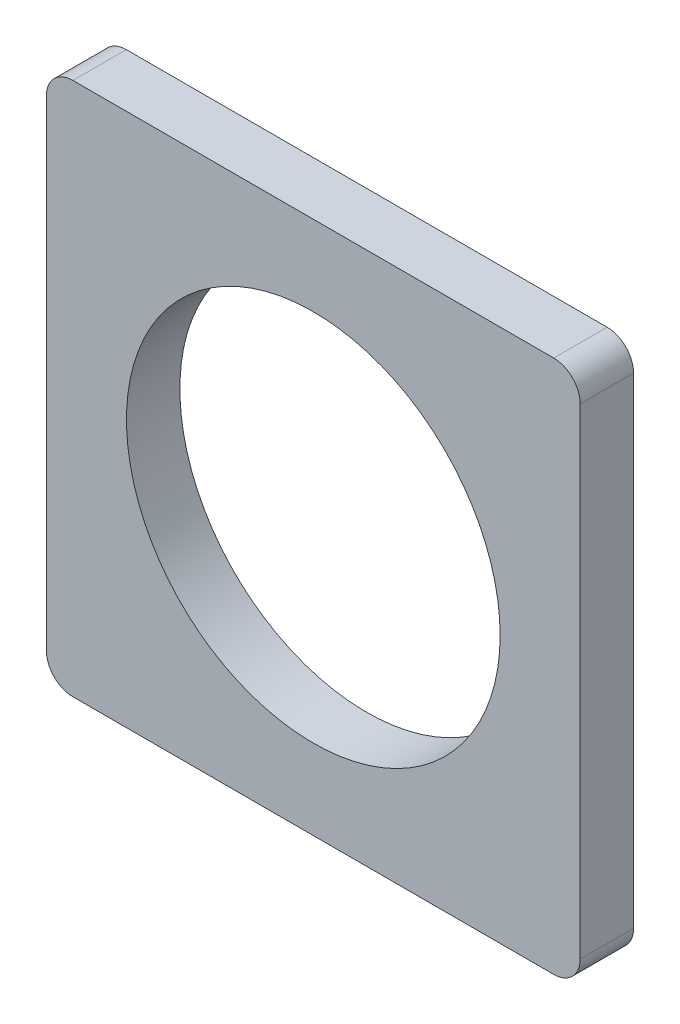
ISO-10303-21;
HEADER;
FILE_DESCRIPTION(('STEP AP214'),'2;1');
FILE_NAME('part.step','',(''),(''),'','','');
FILE_SCHEMA(('AUTOMOTIVE_DESIGN { 1 0 10303 214 1 1 1 1 }'));
ENDSEC;
DATA;
#1=APPLICATION_CONTEXT('core data for automotive mechanical design processes');
#2=APPLICATION_PROTOCOL_DEFINITION('international standard','automotive_design',2000,#1);
#3=PRODUCT_CONTEXT('',#1,'mechanical');
#4=PRODUCT('Part','Part','',(#3));
#5=PRODUCT_RELATED_PRODUCT_CATEGORY('part','',(#4));
#6=PRODUCT_DEFINITION_FORMATION('','',#4);
#7=PRODUCT_DEFINITION_CONTEXT('part definition',#1,'design');
#8=PRODUCT_DEFINITION('design','',#6,#7);
#9=PRODUCT_DEFINITION_SHAPE('','',#8);
#10=(LENGTH_UNIT() NAMED_UNIT(*) SI_UNIT(.MILLI.,.METRE.));
#11=(NAMED_UNIT(*) PLANE_ANGLE_UNIT() SI_UNIT($,.RADIAN.));
#12=(NAMED_UNIT(*) SI_UNIT($,.STERADIAN.) SOLID_ANGLE_UNIT());
#13=UNCERTAINTY_MEASURE_WITH_UNIT(LENGTH_MEASURE(1.E-05),#10,'distance_accuracy_value','');
#14=(GEOMETRIC_REPRESENTATION_CONTEXT(3) GLOBAL_UNCERTAINTY_ASSIGNED_CONTEXT((#13)) GLOBAL_UNIT_ASSIGNED_CONTEXT((#10,
#11,#12)) REPRESENTATION_CONTEXT('',''));
#15=CARTESIAN_POINT('',(0.,0.,0.));
#16=DIRECTION('',(0.,0.,1.));
#17=DIRECTION('',(1.,0.,0.));
#18=AXIS2_PLACEMENT_3D('',#15,#16,#17);
#19=CARTESIAN_POINT('',(-1.76549306753944,0.591651135017614,0.));
#20=DIRECTION('',(0.,0.,1.));
#21=DIRECTION('',(1.,0.,0.));
#22=AXIS2_PLACEMENT_3D('',#19,#20,#21);
#23=PLANE('',#22);
#24=CARTESIAN_POINT('',(-1.76549306753944,0.591651135017614,0.));
#25=DIRECTION('',(0.,0.,1.));
#26=DIRECTION('',(1.,0.,0.));
#27=AXIS2_PLACEMENT_3D('',#24,#25,#26);
#28=CIRCLE('',#27,11.1125);
#29=CARTESIAN_POINT('',(9.34700693246056,0.591651135017614,0.));
#30=VERTEX_POINT('',#29);
#31=EDGE_CURVE('E99',#30,#30,#28,.T.);
#32=ORIENTED_EDGE('',*,*,#31,.T.);
#33=EDGE_LOOP('',(#32));
#34=FACE_BOUND('',#33,.T.);
#35=DIRECTION('',(0.,1.,0.));
#36=VECTOR('',#35,1.);
#37=CARTESIAN_POINT('',(-17.6404930675394,-15.2833488649824,0.));
#38=LINE('',#37,#36);
#39=CARTESIAN_POINT('',(-17.6404930675394,14.8918511350176,0.));
#40=VERTEX_POINT('',#39);
#41=CARTESIAN_POINT('',(-17.6404930675394,-13.7085488649824,0.));
#42=VERTEX_POINT('',#41);
#43=EDGE_CURVE('E83',#40,#42,#38,.F.);
#44=ORIENTED_EDGE('',*,*,#43,.F.);
#45=CARTESIAN_POINT('',(-16.0656930675394,14.8918511350176,0.));
#46=DIRECTION('',(0.,0.,1.));
#47=DIRECTION('',(1.,0.,0.));
#48=AXIS2_PLACEMENT_3D('',#45,#46,#47);
#49=CIRCLE('',#48,1.5748);
#50=CARTESIAN_POINT('',(-16.0656930675394,16.4666511350176,0.));
#51=VERTEX_POINT('',#50);
#52=EDGE_CURVE('E96',#51,#40,#49,.T.);
#53=ORIENTED_EDGE('',*,*,#52,.F.);
#54=DIRECTION('',(1.,0.,0.));
#55=VECTOR('',#54,1.);
#56=CARTESIAN_POINT('',(-17.6404930675394,16.4666511350176,0.));
#57=LINE('',#56,#55);
#58=CARTESIAN_POINT('',(12.5347069324606,16.4666511350176,0.));
#59=VERTEX_POINT('',#58);
#60=EDGE_CURVE('E107',#59,#51,#57,.F.);
#61=ORIENTED_EDGE('',*,*,#60,.F.);
#62=CARTESIAN_POINT('',(12.5347069324606,14.8918511350176,0.));
#63=DIRECTION('',(0.,0.,1.));
#64=DIRECTION('',(1.,0.,0.));
#65=AXIS2_PLACEMENT_3D('',#62,#63,#64);
#66=CIRCLE('',#65,1.5748);
#67=CARTESIAN_POINT('',(14.1095069324606,14.8918511350176,0.));
#68=VERTEX_POINT('',#67);
#69=EDGE_CURVE('E131',#68,#59,#66,.T.);
#70=ORIENTED_EDGE('',*,*,#69,.F.);
#71=DIRECTION('',(0.,1.,0.));
#72=VECTOR('',#71,1.);
#73=CARTESIAN_POINT('',(14.1095069324606,16.4666511350176,0.));
#74=LINE('',#73,#72);
#75=CARTESIAN_POINT('',(14.1095069324606,-13.7085488649824,0.));
#76=VERTEX_POINT('',#75);
#77=EDGE_CURVE('E111',#76,#68,#74,.T.);
#78=ORIENTED_EDGE('',*,*,#77,.F.);
#79=CARTESIAN_POINT('',(12.5347069324606,-13.7085488649824,0.));
#80=DIRECTION('',(0.,0.,1.));
#81=DIRECTION('',(1.,0.,0.));
#82=AXIS2_PLACEMENT_3D('',#79,#80,#81);
#83=CIRCLE('',#82,1.5748);
#84=CARTESIAN_POINT('',(12.5347069324606,-15.2833488649824,0.));
#85=VERTEX_POINT('',#84);
#86=EDGE_CURVE('E132',#85,#76,#83,.T.);
#87=ORIENTED_EDGE('',*,*,#86,.F.);
#88=DIRECTION('',(1.,0.,0.));
#89=VECTOR('',#88,1.);
#90=CARTESIAN_POINT('',(14.1095069324606,-15.2833488649824,0.));
#91=LINE('',#90,#89);
#92=CARTESIAN_POINT('',(-16.0656930675394,-15.2833488649824,0.));
#93=VERTEX_POINT('',#92);
#94=EDGE_CURVE('E85',#93,#85,#91,.T.);
#95=ORIENTED_EDGE('',*,*,#94,.F.);
#96=CARTESIAN_POINT('',(-16.0656930675394,-13.7085488649824,0.));
#97=DIRECTION('',(0.,0.,1.));
#98=DIRECTION('',(1.,0.,0.));
#99=AXIS2_PLACEMENT_3D('',#96,#97,#98);
#100=CIRCLE('',#99,1.5748);
#101=EDGE_CURVE('E20',#42,#93,#100,.T.);
#102=ORIENTED_EDGE('',*,*,#101,.F.);
#103=EDGE_LOOP('',(#44,#53,#61,#70,#78,#87,#95,#102));
#104=FACE_BOUND('',#103,.T.);
#105=ADVANCED_FACE('F17',(#34,#104),#23,.F.);
#106=CARTESIAN_POINT('',(-16.0656930675394,-13.7085488649824,0.));
#107=DIRECTION('',(0.,0.,1.));
#108=DIRECTION('',(1.,0.,0.));
#109=AXIS2_PLACEMENT_3D('',#106,#107,#108);
#110=CYLINDRICAL_SURFACE('',#109,1.5748);
#111=ORIENTED_EDGE('',*,*,#101,.T.);
#112=DIRECTION('',(0.,0.,-1.));
#113=VECTOR('',#112,1.);
#114=CARTESIAN_POINT('',(-16.0656930675394,-15.2833488649824,0.));
#115=LINE('',#114,#113);
#116=CARTESIAN_POINT('',(-16.0656930675394,-15.2833488649824,3.175));
#117=VERTEX_POINT('',#116);
#118=EDGE_CURVE('E88',#117,#93,#115,.T.);
#119=ORIENTED_EDGE('',*,*,#118,.F.);
#120=CARTESIAN_POINT('',(-16.0656930675394,-13.7085488649824,3.175));
#121=DIRECTION('',(0.,0.,1.));
#122=DIRECTION('',(1.,0.,0.));
#123=AXIS2_PLACEMENT_3D('',#120,#121,#122);
#124=CIRCLE('',#123,1.5748);
#125=CARTESIAN_POINT('',(-17.6404930675394,-13.7085488649824,3.175));
#126=VERTEX_POINT('',#125);
#127=EDGE_CURVE('E93',#126,#117,#124,.T.);
#128=ORIENTED_EDGE('',*,*,#127,.F.);
#129=DIRECTION('',(0.,0.,1.));
#130=VECTOR('',#129,1.);
#131=CARTESIAN_POINT('',(-17.6404930675394,-13.7085488649824,0.));
#132=LINE('',#131,#130);
#133=EDGE_CURVE('E90',#42,#126,#132,.T.);
#134=ORIENTED_EDGE('',*,*,#133,.F.);
#135=EDGE_LOOP('',(#111,#119,#128,#134));
#136=FACE_BOUND('',#135,.T.);
#137=ADVANCED_FACE('F91',(#136),#110,.T.);
#138=CARTESIAN_POINT('',(14.1095069324606,-15.2833488649824,0.));
#139=DIRECTION('',(0.,-1.,0.));
#140=DIRECTION('',(0.,0.,-1.));
#141=AXIS2_PLACEMENT_3D('',#138,#139,#140);
#142=PLANE('',#141);
#143=DIRECTION('',(0.,0.,1.));
#144=VECTOR('',#143,1.);
#145=CARTESIAN_POINT('',(12.5347069324606,-15.2833488649824,0.));
#146=LINE('',#145,#144);
#147=CARTESIAN_POINT('',(12.5347069324606,-15.2833488649824,3.175));
#148=VERTEX_POINT('',#147);
#149=EDGE_CURVE('E115',#148,#85,#146,.F.);
#150=ORIENTED_EDGE('',*,*,#149,.F.);
#151=DIRECTION('',(1.,0.,0.));
#152=VECTOR('',#151,1.);
#153=CARTESIAN_POINT('',(-1.76549306753944,-15.2833488649824,3.175));
#154=LINE('',#153,#152);
#155=EDGE_CURVE('E128',#117,#148,#154,.T.);
#156=ORIENTED_EDGE('',*,*,#155,.F.);
#157=ORIENTED_EDGE('',*,*,#118,.T.);
#158=ORIENTED_EDGE('',*,*,#94,.T.);
#159=EDGE_LOOP('',(#150,#156,#157,#158));
#160=FACE_BOUND('',#159,.T.);
#161=ADVANCED_FACE('F169',(#160),#142,.T.);
#162=CARTESIAN_POINT('',(12.5347069324606,-13.7085488649824,0.));
#163=DIRECTION('',(0.,0.,1.));
#164=DIRECTION('',(1.,0.,0.));
#165=AXIS2_PLACEMENT_3D('',#162,#163,#164);
#166=CYLINDRICAL_SURFACE('',#165,1.5748);
#167=ORIENTED_EDGE('',*,*,#86,.T.);
#168=DIRECTION('',(0.,0.,-1.));
#169=VECTOR('',#168,1.);
#170=CARTESIAN_POINT('',(14.1095069324606,-13.7085488649824,0.));
#171=LINE('',#170,#169);
#172=CARTESIAN_POINT('',(14.1095069324606,-13.7085488649824,3.175));
#173=VERTEX_POINT('',#172);
#174=EDGE_CURVE('E114',#173,#76,#171,.T.);
#175=ORIENTED_EDGE('',*,*,#174,.F.);
#176=CARTESIAN_POINT('',(12.5347069324606,-13.7085488649824,3.175));
#177=DIRECTION('',(0.,0.,1.));
#178=DIRECTION('',(1.,0.,0.));
#179=AXIS2_PLACEMENT_3D('',#176,#177,#178);
#180=CIRCLE('',#179,1.5748);
#181=EDGE_CURVE('E125',#148,#173,#180,.T.);
#182=ORIENTED_EDGE('',*,*,#181,.F.);
#183=ORIENTED_EDGE('',*,*,#149,.T.);
#184=EDGE_LOOP('',(#167,#175,#182,#183));
#185=FACE_BOUND('',#184,.T.);
#186=ADVANCED_FACE('F166',(#185),#166,.T.);
#187=CARTESIAN_POINT('',(14.1095069324606,16.4666511350176,0.));
#188=DIRECTION('',(1.,0.,0.));
#189=DIRECTION('',(0.,0.,-1.));
#190=AXIS2_PLACEMENT_3D('',#187,#188,#189);
#191=PLANE('',#190);
#192=DIRECTION('',(0.,0.,1.));
#193=VECTOR('',#192,1.);
#194=CARTESIAN_POINT('',(14.1095069324606,14.8918511350176,0.));
#195=LINE('',#194,#193);
#196=CARTESIAN_POINT('',(14.1095069324606,14.8918511350176,3.175));
#197=VERTEX_POINT('',#196);
#198=EDGE_CURVE('E113',#197,#68,#195,.F.);
#199=ORIENTED_EDGE('',*,*,#198,.F.);
#200=DIRECTION('',(0.,1.,0.));
#201=VECTOR('',#200,1.);
#202=CARTESIAN_POINT('',(14.1095069324606,0.591651135017614,3.175));
#203=LINE('',#202,#201);
#204=EDGE_CURVE('E124',#173,#197,#203,.T.);
#205=ORIENTED_EDGE('',*,*,#204,.F.);
#206=ORIENTED_EDGE('',*,*,#174,.T.);
#207=ORIENTED_EDGE('',*,*,#77,.T.);
#208=EDGE_LOOP('',(#199,#205,#206,#207));
#209=FACE_BOUND('',#208,.T.);
#210=ADVANCED_FACE('F165',(#209),#191,.T.);
#211=CARTESIAN_POINT('',(12.5347069324606,14.8918511350176,0.));
#212=DIRECTION('',(0.,0.,1.));
#213=DIRECTION('',(1.,0.,0.));
#214=AXIS2_PLACEMENT_3D('',#211,#212,#213);
#215=CYLINDRICAL_SURFACE('',#214,1.5748);
#216=ORIENTED_EDGE('',*,*,#69,.T.);
#217=DIRECTION('',(0.,0.,1.));
#218=VECTOR('',#217,1.);
#219=CARTESIAN_POINT('',(12.5347069324606,16.4666511350176,0.));
#220=LINE('',#219,#218);
#221=CARTESIAN_POINT('',(12.5347069324606,16.4666511350176,3.175));
#222=VERTEX_POINT('',#221);
#223=EDGE_CURVE('E110',#222,#59,#220,.F.);
#224=ORIENTED_EDGE('',*,*,#223,.F.);
#225=CARTESIAN_POINT('',(12.5347069324606,14.8918511350176,3.175));
#226=DIRECTION('',(0.,0.,1.));
#227=DIRECTION('',(1.,0.,0.));
#228=AXIS2_PLACEMENT_3D('',#225,#226,#227);
#229=CIRCLE('',#228,1.5748);
#230=EDGE_CURVE('E121',#197,#222,#229,.T.);
#231=ORIENTED_EDGE('',*,*,#230,.F.);
#232=ORIENTED_EDGE('',*,*,#198,.T.);
#233=EDGE_LOOP('',(#216,#224,#231,#232));
#234=FACE_BOUND('',#233,.T.);
#235=ADVANCED_FACE('F162',(#234),#215,.T.);
#236=CARTESIAN_POINT('',(-17.6404930675394,16.4666511350176,0.));
#237=DIRECTION('',(0.,1.,0.));
#238=DIRECTION('',(0.,0.,1.));
#239=AXIS2_PLACEMENT_3D('',#236,#237,#238);
#240=PLANE('',#239);
#241=DIRECTION('',(0.,0.,1.));
#242=VECTOR('',#241,1.);
#243=CARTESIAN_POINT('',(-16.0656930675394,16.4666511350176,0.));
#244=LINE('',#243,#242);
#245=CARTESIAN_POINT('',(-16.0656930675394,16.4666511350176,3.175));
#246=VERTEX_POINT('',#245);
#247=EDGE_CURVE('E109',#246,#51,#244,.F.);
#248=ORIENTED_EDGE('',*,*,#247,.F.);
#249=DIRECTION('',(1.,0.,0.));
#250=VECTOR('',#249,1.);
#251=CARTESIAN_POINT('',(-1.76549306753944,16.4666511350176,3.175));
#252=LINE('',#251,#250);
#253=EDGE_CURVE('E120',#222,#246,#252,.F.);
#254=ORIENTED_EDGE('',*,*,#253,.F.);
#255=ORIENTED_EDGE('',*,*,#223,.T.);
#256=ORIENTED_EDGE('',*,*,#60,.T.);
#257=EDGE_LOOP('',(#248,#254,#255,#256));
#258=FACE_BOUND('',#257,.T.);
#259=ADVANCED_FACE('F157',(#258),#240,.T.);
#260=CARTESIAN_POINT('',(-16.0656930675394,14.8918511350176,0.));
#261=DIRECTION('',(0.,0.,1.));
#262=DIRECTION('',(1.,0.,0.));
#263=AXIS2_PLACEMENT_3D('',#260,#261,#262);
#264=CYLINDRICAL_SURFACE('',#263,1.5748);
#265=ORIENTED_EDGE('',*,*,#52,.T.);
#266=DIRECTION('',(0.,0.,1.));
#267=VECTOR('',#266,1.);
#268=CARTESIAN_POINT('',(-17.6404930675394,14.8918511350176,0.));
#269=LINE('',#268,#267);
#270=CARTESIAN_POINT('',(-17.6404930675394,14.8918511350176,3.175));
#271=VERTEX_POINT('',#270);
#272=EDGE_CURVE('E35',#271,#40,#269,.F.);
#273=ORIENTED_EDGE('',*,*,#272,.F.);
#274=CARTESIAN_POINT('',(-16.0656930675394,14.8918511350176,3.175));
#275=DIRECTION('',(0.,0.,1.));
#276=DIRECTION('',(1.,0.,0.));
#277=AXIS2_PLACEMENT_3D('',#274,#275,#276);
#278=CIRCLE('',#277,1.5748);
#279=EDGE_CURVE('E117',#246,#271,#278,.T.);
#280=ORIENTED_EDGE('',*,*,#279,.F.);
#281=ORIENTED_EDGE('',*,*,#247,.T.);
#282=EDGE_LOOP('',(#265,#273,#280,#281));
#283=FACE_BOUND('',#282,.T.);
#284=ADVANCED_FACE('F155',(#283),#264,.T.);
#285=CARTESIAN_POINT('',(-17.6404930675394,-15.2833488649824,0.));
#286=DIRECTION('',(-1.,0.,0.));
#287=DIRECTION('',(0.,0.,1.));
#288=AXIS2_PLACEMENT_3D('',#285,#286,#287);
#289=PLANE('',#288);
#290=ORIENTED_EDGE('',*,*,#272,.T.);
#291=ORIENTED_EDGE('',*,*,#43,.T.);
#292=ORIENTED_EDGE('',*,*,#133,.T.);
#293=DIRECTION('',(0.,1.,0.));
#294=VECTOR('',#293,1.);
#295=CARTESIAN_POINT('',(-17.6404930675394,0.591651135017614,3.175));
#296=LINE('',#295,#294);
#297=EDGE_CURVE('E26',#271,#126,#296,.F.);
#298=ORIENTED_EDGE('',*,*,#297,.F.);
#299=EDGE_LOOP('',(#290,#291,#292,#298));
#300=FACE_BOUND('',#299,.T.);
#301=ADVANCED_FACE('F98',(#300),#289,.T.);
#302=CARTESIAN_POINT('',(-1.76549306753944,0.591651135017614,0.));
#303=DIRECTION('',(0.,0.,1.));
#304=DIRECTION('',(1.,0.,0.));
#305=AXIS2_PLACEMENT_3D('',#302,#303,#304);
#306=CYLINDRICAL_SURFACE('',#305,11.1125);
#307=ORIENTED_EDGE('',*,*,#31,.F.);
#308=EDGE_LOOP('',(#307));
#309=FACE_BOUND('',#308,.T.);
#310=CARTESIAN_POINT('',(-1.76549306753944,0.591651135017614,3.175));
#311=DIRECTION('',(0.,0.,1.));
#312=DIRECTION('',(1.,0.,0.));
#313=AXIS2_PLACEMENT_3D('',#310,#311,#312);
#314=CIRCLE('',#313,11.1125);
#315=CARTESIAN_POINT('',(9.34700693246056,0.591651135017614,3.175));
#316=VERTEX_POINT('',#315);
#317=EDGE_CURVE('E11',#316,#316,#314,.F.);
#318=ORIENTED_EDGE('',*,*,#317,.F.);
#319=EDGE_LOOP('',(#318));
#320=FACE_BOUND('',#319,.T.);
#321=ADVANCED_FACE('F179',(#309,#320),#306,.F.);
#322=CARTESIAN_POINT('',(-1.76549306753944,0.591651135017614,3.175));
#323=DIRECTION('',(0.,0.,1.));
#324=DIRECTION('',(1.,0.,0.));
#325=AXIS2_PLACEMENT_3D('',#322,#323,#324);
#326=PLANE('',#325);
#327=ORIENTED_EDGE('',*,*,#317,.T.);
#328=EDGE_LOOP('',(#327));
#329=FACE_BOUND('',#328,.T.);
#330=ORIENTED_EDGE('',*,*,#279,.T.);
#331=ORIENTED_EDGE('',*,*,#297,.T.);
#332=ORIENTED_EDGE('',*,*,#127,.T.);
#333=ORIENTED_EDGE('',*,*,#155,.T.);
#334=ORIENTED_EDGE('',*,*,#181,.T.);
#335=ORIENTED_EDGE('',*,*,#204,.T.);
#336=ORIENTED_EDGE('',*,*,#230,.T.);
#337=ORIENTED_EDGE('',*,*,#253,.T.);
#338=EDGE_LOOP('',(#330,#331,#332,#333,#334,#335,#336,#337));
#339=FACE_BOUND('',#338,.T.);
#340=ADVANCED_FACE('F153',(#329,#339),#326,.T.);
#341=CLOSED_SHELL('',(#105,#137,#161,#186,#210,#235,#259,#284,#301,#321,#340));
#342=MANIFOLD_SOLID_BREP('B1',#341);
#343=ADVANCED_BREP_SHAPE_REPRESENTATION('',(#18,#342),#14);
#344=SHAPE_DEFINITION_REPRESENTATION(#9,#343);
ENDSEC;
END-ISO-10303-21;
